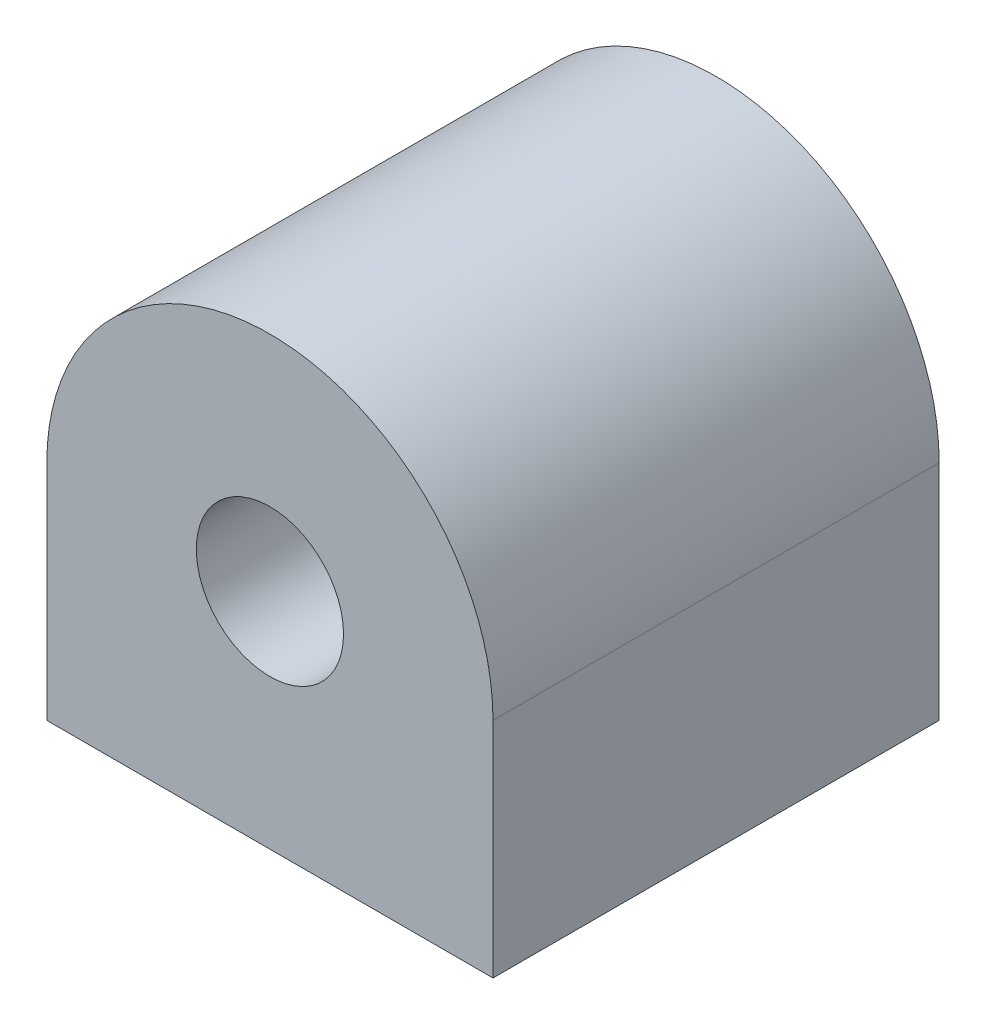
ISO-10303-21;
HEADER;
FILE_DESCRIPTION(('STEP AP214'),'2;1');
FILE_NAME('part.step','',(''),(''),'','','');
FILE_SCHEMA(('AUTOMOTIVE_DESIGN { 1 0 10303 214 1 1 1 1 }'));
ENDSEC;
DATA;
#1=APPLICATION_CONTEXT('core data for automotive mechanical design processes');
#2=APPLICATION_PROTOCOL_DEFINITION('international standard','automotive_design',2000,#1);
#3=PRODUCT_CONTEXT('',#1,'mechanical');
#4=PRODUCT('Part','Part','',(#3));
#5=PRODUCT_RELATED_PRODUCT_CATEGORY('part','',(#4));
#6=PRODUCT_DEFINITION_FORMATION('','',#4);
#7=PRODUCT_DEFINITION_CONTEXT('part definition',#1,'design');
#8=PRODUCT_DEFINITION('design','',#6,#7);
#9=PRODUCT_DEFINITION_SHAPE('','',#8);
#10=(LENGTH_UNIT() NAMED_UNIT(*) SI_UNIT(.MILLI.,.METRE.));
#11=(NAMED_UNIT(*) PLANE_ANGLE_UNIT() SI_UNIT($,.RADIAN.));
#12=(NAMED_UNIT(*) SI_UNIT($,.STERADIAN.) SOLID_ANGLE_UNIT());
#13=UNCERTAINTY_MEASURE_WITH_UNIT(LENGTH_MEASURE(1.E-05),#10,'distance_accuracy_value','');
#14=(GEOMETRIC_REPRESENTATION_CONTEXT(3) GLOBAL_UNCERTAINTY_ASSIGNED_CONTEXT((#13)) GLOBAL_UNIT_ASSIGNED_CONTEXT((#10,
#11,#12)) REPRESENTATION_CONTEXT('',''));
#15=CARTESIAN_POINT('',(0.,0.,0.));
#16=DIRECTION('',(0.,0.,1.));
#17=DIRECTION('',(1.,0.,0.));
#18=AXIS2_PLACEMENT_3D('',#15,#16,#17);
#19=CARTESIAN_POINT('',(0.,0.,10.));
#20=DIRECTION('',(0.,0.,-1.));
#21=DIRECTION('',(-1.,0.,0.));
#22=AXIS2_PLACEMENT_3D('',#19,#20,#21);
#23=PLANE('',#22);
#24=CARTESIAN_POINT('',(0.,0.,10.));
#25=DIRECTION('',(0.,0.,1.));
#26=DIRECTION('',(-1.,0.,0.));
#27=AXIS2_PLACEMENT_3D('',#24,#25,#26);
#28=CIRCLE('',#27,5.);
#29=CARTESIAN_POINT('',(5.,0.,10.));
#30=VERTEX_POINT('',#29);
#31=CARTESIAN_POINT('',(-5.,0.,10.));
#32=VERTEX_POINT('',#31);
#33=EDGE_CURVE('E85',#30,#32,#28,.T.);
#34=ORIENTED_EDGE('',*,*,#33,.T.);
#35=DIRECTION('',(0.,-1.,0.));
#36=VECTOR('',#35,1.);
#37=CARTESIAN_POINT('',(-5.,0.,10.));
#38=LINE('',#37,#36);
#39=CARTESIAN_POINT('',(-5.,-5.,10.));
#40=VERTEX_POINT('',#39);
#41=EDGE_CURVE('E80',#32,#40,#38,.T.);
#42=ORIENTED_EDGE('',*,*,#41,.T.);
#43=DIRECTION('',(1.,0.,0.));
#44=VECTOR('',#43,1.);
#45=CARTESIAN_POINT('',(5.,-5.,10.));
#46=LINE('',#45,#44);
#47=CARTESIAN_POINT('',(5.,-5.,10.));
#48=VERTEX_POINT('',#47);
#49=EDGE_CURVE('E83',#40,#48,#46,.T.);
#50=ORIENTED_EDGE('',*,*,#49,.T.);
#51=DIRECTION('',(0.,1.,0.));
#52=VECTOR('',#51,1.);
#53=CARTESIAN_POINT('',(5.,0.,10.));
#54=LINE('',#53,#52);
#55=EDGE_CURVE('E50',#48,#30,#54,.T.);
#56=ORIENTED_EDGE('',*,*,#55,.T.);
#57=EDGE_LOOP('',(#34,#42,#50,#56));
#58=FACE_BOUND('',#57,.T.);
#59=CARTESIAN_POINT('',(0.,0.,10.));
#60=DIRECTION('',(0.,0.,1.));
#61=DIRECTION('',(1.,0.,0.));
#62=AXIS2_PLACEMENT_3D('',#59,#60,#61);
#63=CIRCLE('',#62,1.65);
#64=CARTESIAN_POINT('',(1.65,0.,10.));
#65=VERTEX_POINT('',#64);
#66=EDGE_CURVE('E100',#65,#65,#63,.T.);
#67=ORIENTED_EDGE('',*,*,#66,.F.);
#68=EDGE_LOOP('',(#67));
#69=FACE_BOUND('',#68,.T.);
#70=ADVANCED_FACE('F33',(#58,#69),#23,.F.);
#71=CARTESIAN_POINT('',(0.,0.,0.));
#72=DIRECTION('',(0.,0.,-1.));
#73=DIRECTION('',(-1.,0.,0.));
#74=AXIS2_PLACEMENT_3D('',#71,#72,#73);
#75=PLANE('',#74);
#76=CARTESIAN_POINT('',(0.,0.,0.));
#77=DIRECTION('',(0.,0.,1.));
#78=DIRECTION('',(-1.,0.,0.));
#79=AXIS2_PLACEMENT_3D('',#76,#77,#78);
#80=CIRCLE('',#79,5.);
#81=CARTESIAN_POINT('',(5.,0.,0.));
#82=VERTEX_POINT('',#81);
#83=CARTESIAN_POINT('',(-5.,0.,0.));
#84=VERTEX_POINT('',#83);
#85=EDGE_CURVE('E97',#82,#84,#80,.T.);
#86=ORIENTED_EDGE('',*,*,#85,.F.);
#87=DIRECTION('',(0.,1.,0.));
#88=VECTOR('',#87,1.);
#89=CARTESIAN_POINT('',(5.,0.,0.));
#90=LINE('',#89,#88);
#91=CARTESIAN_POINT('',(5.,-5.,0.));
#92=VERTEX_POINT('',#91);
#93=EDGE_CURVE('E73',#92,#82,#90,.T.);
#94=ORIENTED_EDGE('',*,*,#93,.F.);
#95=DIRECTION('',(1.,0.,0.));
#96=VECTOR('',#95,1.);
#97=CARTESIAN_POINT('',(5.,-5.,0.));
#98=LINE('',#97,#96);
#99=CARTESIAN_POINT('',(-5.,-5.,0.));
#100=VERTEX_POINT('',#99);
#101=EDGE_CURVE('E67',#100,#92,#98,.T.);
#102=ORIENTED_EDGE('',*,*,#101,.F.);
#103=DIRECTION('',(0.,-1.,0.));
#104=VECTOR('',#103,1.);
#105=CARTESIAN_POINT('',(-5.,0.,0.));
#106=LINE('',#105,#104);
#107=EDGE_CURVE('E89',#84,#100,#106,.T.);
#108=ORIENTED_EDGE('',*,*,#107,.F.);
#109=EDGE_LOOP('',(#86,#94,#102,#108));
#110=FACE_BOUND('',#109,.T.);
#111=CARTESIAN_POINT('',(0.,0.,0.));
#112=DIRECTION('',(0.,0.,1.));
#113=DIRECTION('',(1.,0.,0.));
#114=AXIS2_PLACEMENT_3D('',#111,#112,#113);
#115=CIRCLE('',#114,1.65);
#116=CARTESIAN_POINT('',(1.65,0.,0.));
#117=VERTEX_POINT('',#116);
#118=EDGE_CURVE('E112',#117,#117,#115,.T.);
#119=ORIENTED_EDGE('',*,*,#118,.T.);
#120=EDGE_LOOP('',(#119));
#121=FACE_BOUND('',#120,.T.);
#122=ADVANCED_FACE('F108',(#110,#121),#75,.T.);
#123=CARTESIAN_POINT('',(0.,0.,10.));
#124=DIRECTION('',(0.,0.,-1.));
#125=DIRECTION('',(-1.,0.,0.));
#126=AXIS2_PLACEMENT_3D('',#123,#124,#125);
#127=CYLINDRICAL_SURFACE('',#126,5.);
#128=ORIENTED_EDGE('',*,*,#85,.T.);
#129=DIRECTION('',(0.,0.,-1.));
#130=VECTOR('',#129,1.);
#131=CARTESIAN_POINT('',(-5.,0.,10.));
#132=LINE('',#131,#130);
#133=EDGE_CURVE('E11',#32,#84,#132,.T.);
#134=ORIENTED_EDGE('',*,*,#133,.F.);
#135=ORIENTED_EDGE('',*,*,#33,.F.);
#136=DIRECTION('',(0.,0.,-1.));
#137=VECTOR('',#136,1.);
#138=CARTESIAN_POINT('',(5.,0.,10.));
#139=LINE('',#138,#137);
#140=EDGE_CURVE('E93',#30,#82,#139,.T.);
#141=ORIENTED_EDGE('',*,*,#140,.T.);
#142=EDGE_LOOP('',(#128,#134,#135,#141));
#143=FACE_BOUND('',#142,.T.);
#144=ADVANCED_FACE('F35',(#143),#127,.T.);
#145=CARTESIAN_POINT('',(-5.,0.,10.));
#146=DIRECTION('',(1.,0.,0.));
#147=DIRECTION('',(0.,0.,-1.));
#148=AXIS2_PLACEMENT_3D('',#145,#146,#147);
#149=PLANE('',#148);
#150=ORIENTED_EDGE('',*,*,#107,.T.);
#151=DIRECTION('',(0.,0.,-1.));
#152=VECTOR('',#151,1.);
#153=CARTESIAN_POINT('',(-5.,-5.,10.));
#154=LINE('',#153,#152);
#155=EDGE_CURVE('E42',#40,#100,#154,.T.);
#156=ORIENTED_EDGE('',*,*,#155,.F.);
#157=ORIENTED_EDGE('',*,*,#41,.F.);
#158=ORIENTED_EDGE('',*,*,#133,.T.);
#159=EDGE_LOOP('',(#150,#156,#157,#158));
#160=FACE_BOUND('',#159,.T.);
#161=ADVANCED_FACE('F88',(#160),#149,.F.);
#162=CARTESIAN_POINT('',(5.,-5.,10.));
#163=DIRECTION('',(0.,1.,0.));
#164=DIRECTION('',(-1.,0.,0.));
#165=AXIS2_PLACEMENT_3D('',#162,#163,#164);
#166=PLANE('',#165);
#167=ORIENTED_EDGE('',*,*,#101,.T.);
#168=DIRECTION('',(0.,0.,-1.));
#169=VECTOR('',#168,1.);
#170=CARTESIAN_POINT('',(5.,-5.,10.));
#171=LINE('',#170,#169);
#172=EDGE_CURVE('E90',#48,#92,#171,.T.);
#173=ORIENTED_EDGE('',*,*,#172,.F.);
#174=ORIENTED_EDGE('',*,*,#49,.F.);
#175=ORIENTED_EDGE('',*,*,#155,.T.);
#176=EDGE_LOOP('',(#167,#173,#174,#175));
#177=FACE_BOUND('',#176,.T.);
#178=ADVANCED_FACE('F91',(#177),#166,.F.);
#179=CARTESIAN_POINT('',(5.,0.,10.));
#180=DIRECTION('',(-1.,0.,0.));
#181=DIRECTION('',(0.,-1.,0.));
#182=AXIS2_PLACEMENT_3D('',#179,#180,#181);
#183=PLANE('',#182);
#184=ORIENTED_EDGE('',*,*,#93,.T.);
#185=ORIENTED_EDGE('',*,*,#140,.F.);
#186=ORIENTED_EDGE('',*,*,#55,.F.);
#187=ORIENTED_EDGE('',*,*,#172,.T.);
#188=EDGE_LOOP('',(#184,#185,#186,#187));
#189=FACE_BOUND('',#188,.T.);
#190=ADVANCED_FACE('F105',(#189),#183,.F.);
#191=CARTESIAN_POINT('',(0.,0.,10.));
#192=DIRECTION('',(0.,0.,-1.));
#193=DIRECTION('',(-1.,0.,0.));
#194=AXIS2_PLACEMENT_3D('',#191,#192,#193);
#195=CYLINDRICAL_SURFACE('',#194,1.65);
#196=ORIENTED_EDGE('',*,*,#66,.T.);
#197=EDGE_LOOP('',(#196));
#198=FACE_BOUND('',#197,.T.);
#199=ORIENTED_EDGE('',*,*,#118,.F.);
#200=EDGE_LOOP('',(#199));
#201=FACE_BOUND('',#200,.T.);
#202=ADVANCED_FACE('F118',(#198,#201),#195,.F.);
#203=CLOSED_SHELL('',(#70,#122,#144,#161,#178,#190,#202));
#204=MANIFOLD_SOLID_BREP('B2',#203);
#205=ADVANCED_BREP_SHAPE_REPRESENTATION('',(#18,#204),#14);
#206=SHAPE_DEFINITION_REPRESENTATION(#9,#205);
ENDSEC;
END-ISO-10303-21;
